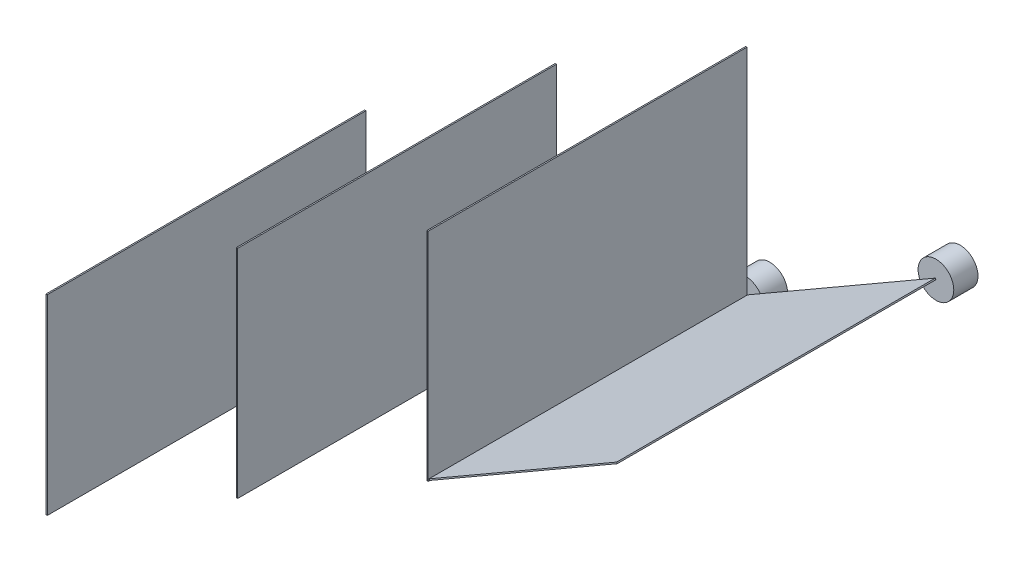
ISO-10303-21;
HEADER;
FILE_DESCRIPTION(('STEP AP214'),'2;1');
FILE_NAME('part.step','',(''),(''),'','','');
FILE_SCHEMA(('AUTOMOTIVE_DESIGN { 1 0 10303 214 1 1 1 1 }'));
ENDSEC;
DATA;
#1=APPLICATION_CONTEXT('core data for automotive mechanical design processes');
#2=APPLICATION_PROTOCOL_DEFINITION('international standard','automotive_design',2000,#1);
#3=PRODUCT_CONTEXT('',#1,'mechanical');
#4=PRODUCT('Part','Part','',(#3));
#5=PRODUCT_RELATED_PRODUCT_CATEGORY('part','',(#4));
#6=PRODUCT_DEFINITION_FORMATION('','',#4);
#7=PRODUCT_DEFINITION_CONTEXT('part definition',#1,'design');
#8=PRODUCT_DEFINITION('design','',#6,#7);
#9=PRODUCT_DEFINITION_SHAPE('','',#8);
#10=(LENGTH_UNIT() NAMED_UNIT(*) SI_UNIT(.MILLI.,.METRE.));
#11=(NAMED_UNIT(*) PLANE_ANGLE_UNIT() SI_UNIT($,.RADIAN.));
#12=(NAMED_UNIT(*) SI_UNIT($,.STERADIAN.) SOLID_ANGLE_UNIT());
#13=UNCERTAINTY_MEASURE_WITH_UNIT(LENGTH_MEASURE(1.E-05),#10,'distance_accuracy_value','');
#14=(GEOMETRIC_REPRESENTATION_CONTEXT(3) GLOBAL_UNCERTAINTY_ASSIGNED_CONTEXT((#13)) GLOBAL_UNIT_ASSIGNED_CONTEXT((#10,
#11,#12)) REPRESENTATION_CONTEXT('',''));
#15=CARTESIAN_POINT('',(0.,0.,0.));
#16=DIRECTION('',(0.,0.,1.));
#17=DIRECTION('',(1.,0.,0.));
#18=AXIS2_PLACEMENT_3D('',#15,#16,#17);
#19=CARTESIAN_POINT('',(-299.943827815092,-173.75,250.));
#20=DIRECTION('',(-1.,0.,0.));
#21=DIRECTION('',(0.,0.,1.));
#22=AXIS2_PLACEMENT_3D('',#19,#20,#21);
#23=PLANE('',#22);
#24=DIRECTION('',(0.,1.,0.));
#25=VECTOR('',#24,1.);
#26=CARTESIAN_POINT('',(-299.943827815092,-173.75,0.));
#27=LINE('',#26,#25);
#28=CARTESIAN_POINT('',(-299.943827815092,-173.75,0.));
#29=VERTEX_POINT('',#28);
#30=CARTESIAN_POINT('',(-299.943827815092,-159.785759956231,0.));
#31=VERTEX_POINT('',#30);
#32=EDGE_CURVE('E103',#29,#31,#27,.T.);
#33=ORIENTED_EDGE('',*,*,#32,.T.);
#34=CARTESIAN_POINT('',(-299.943827815092,-23.7500000000005,0.));
#35=VERTEX_POINT('',#34);
#36=EDGE_CURVE('E116',#31,#35,#27,.T.);
#37=ORIENTED_EDGE('',*,*,#36,.T.);
#38=DIRECTION('',(0.,0.,-1.));
#39=VECTOR('',#38,1.);
#40=CARTESIAN_POINT('',(-299.943827815092,-23.7500000000005,250.));
#41=LINE('',#40,#39);
#42=CARTESIAN_POINT('',(-299.943827815092,-23.7500000000005,250.));
#43=VERTEX_POINT('',#42);
#44=EDGE_CURVE('E12',#43,#35,#41,.T.);
#45=ORIENTED_EDGE('',*,*,#44,.F.);
#46=DIRECTION('',(0.,1.,0.));
#47=VECTOR('',#46,1.);
#48=CARTESIAN_POINT('',(-299.943827815092,-173.75,250.));
#49=LINE('',#48,#47);
#50=CARTESIAN_POINT('',(-299.943827815092,-173.75,250.));
#51=VERTEX_POINT('',#50);
#52=EDGE_CURVE('E132',#51,#43,#49,.T.);
#53=ORIENTED_EDGE('',*,*,#52,.F.);
#54=DIRECTION('',(0.,0.,-1.));
#55=VECTOR('',#54,1.);
#56=CARTESIAN_POINT('',(-299.943827815092,-173.75,250.));
#57=LINE('',#56,#55);
#58=EDGE_CURVE('E123',#51,#29,#57,.T.);
#59=ORIENTED_EDGE('',*,*,#58,.T.);
#60=EDGE_LOOP('',(#33,#37,#45,#53,#59));
#61=FACE_BOUND('',#60,.T.);
#62=ADVANCED_FACE('F50',(#61),#23,.F.);
#63=CARTESIAN_POINT('',(-300.943827815092,-23.7500000000005,250.));
#64=DIRECTION('',(0.,-1.,0.));
#65=DIRECTION('',(0.,0.,-1.));
#66=AXIS2_PLACEMENT_3D('',#63,#64,#65);
#67=PLANE('',#66);
#68=DIRECTION('',(-1.,0.,0.));
#69=VECTOR('',#68,1.);
#70=CARTESIAN_POINT('',(-300.943827815092,-23.7500000000005,0.));
#71=LINE('',#70,#69);
#72=CARTESIAN_POINT('',(-300.943827815092,-23.7500000000005,0.));
#73=VERTEX_POINT('',#72);
#74=EDGE_CURVE('E87',#35,#73,#71,.T.);
#75=ORIENTED_EDGE('',*,*,#74,.T.);
#76=DIRECTION('',(0.,0.,-1.));
#77=VECTOR('',#76,1.);
#78=CARTESIAN_POINT('',(-300.943827815092,-23.7500000000005,250.));
#79=LINE('',#78,#77);
#80=CARTESIAN_POINT('',(-300.943827815092,-23.7500000000005,250.));
#81=VERTEX_POINT('',#80);
#82=EDGE_CURVE('E57',#81,#73,#79,.T.);
#83=ORIENTED_EDGE('',*,*,#82,.F.);
#84=DIRECTION('',(-1.,0.,0.));
#85=VECTOR('',#84,1.);
#86=CARTESIAN_POINT('',(-300.943827815092,-23.7500000000005,250.));
#87=LINE('',#86,#85);
#88=EDGE_CURVE('E92',#43,#81,#87,.T.);
#89=ORIENTED_EDGE('',*,*,#88,.F.);
#90=ORIENTED_EDGE('',*,*,#44,.T.);
#91=EDGE_LOOP('',(#75,#83,#89,#90));
#92=FACE_BOUND('',#91,.T.);
#93=ADVANCED_FACE('F141',(#92),#67,.F.);
#94=CARTESIAN_POINT('',(-300.943827815092,-173.75,250.));
#95=DIRECTION('',(1.,0.,0.));
#96=DIRECTION('',(0.,0.,-1.));
#97=AXIS2_PLACEMENT_3D('',#94,#95,#96);
#98=PLANE('',#97);
#99=DIRECTION('',(0.,-1.,0.));
#100=VECTOR('',#99,1.);
#101=CARTESIAN_POINT('',(-300.943827815092,-173.75,0.));
#102=LINE('',#101,#100);
#103=CARTESIAN_POINT('',(-300.943827815092,-159.75,0.));
#104=VERTEX_POINT('',#103);
#105=EDGE_CURVE('E128',#73,#104,#102,.T.);
#106=ORIENTED_EDGE('',*,*,#105,.T.);
#107=CARTESIAN_POINT('',(-300.943827815092,-173.75,0.));
#108=VERTEX_POINT('',#107);
#109=EDGE_CURVE('E106',#104,#108,#102,.T.);
#110=ORIENTED_EDGE('',*,*,#109,.T.);
#111=DIRECTION('',(0.,0.,-1.));
#112=VECTOR('',#111,1.);
#113=CARTESIAN_POINT('',(-300.943827815092,-173.75,250.));
#114=LINE('',#113,#112);
#115=CARTESIAN_POINT('',(-300.943827815092,-173.75,250.));
#116=VERTEX_POINT('',#115);
#117=EDGE_CURVE('E134',#116,#108,#114,.T.);
#118=ORIENTED_EDGE('',*,*,#117,.F.);
#119=DIRECTION('',(0.,-1.,0.));
#120=VECTOR('',#119,1.);
#121=CARTESIAN_POINT('',(-300.943827815092,-173.75,250.));
#122=LINE('',#121,#120);
#123=EDGE_CURVE('E140',#81,#116,#122,.T.);
#124=ORIENTED_EDGE('',*,*,#123,.F.);
#125=ORIENTED_EDGE('',*,*,#82,.T.);
#126=EDGE_LOOP('',(#106,#110,#118,#124,#125));
#127=FACE_BOUND('',#126,.T.);
#128=ADVANCED_FACE('F138',(#127),#98,.F.);
#129=CARTESIAN_POINT('',(-300.943827815092,-173.75,250.));
#130=DIRECTION('',(0.,1.,0.));
#131=DIRECTION('',(0.,0.,1.));
#132=AXIS2_PLACEMENT_3D('',#129,#130,#131);
#133=PLANE('',#132);
#134=DIRECTION('',(1.,0.,0.));
#135=VECTOR('',#134,1.);
#136=CARTESIAN_POINT('',(-300.943827815092,-173.75,0.));
#137=LINE('',#136,#135);
#138=EDGE_CURVE('E130',#108,#29,#137,.T.);
#139=ORIENTED_EDGE('',*,*,#138,.T.);
#140=ORIENTED_EDGE('',*,*,#58,.F.);
#141=DIRECTION('',(1.,0.,0.));
#142=VECTOR('',#141,1.);
#143=CARTESIAN_POINT('',(-300.943827815092,-173.75,250.));
#144=LINE('',#143,#142);
#145=EDGE_CURVE('E72',#116,#51,#144,.T.);
#146=ORIENTED_EDGE('',*,*,#145,.F.);
#147=ORIENTED_EDGE('',*,*,#117,.T.);
#148=EDGE_LOOP('',(#139,#140,#146,#147));
#149=FACE_BOUND('',#148,.T.);
#150=ADVANCED_FACE('F147',(#149),#133,.F.);
#151=CARTESIAN_POINT('',(0.,0.,250.));
#152=DIRECTION('',(0.,0.,-1.));
#153=DIRECTION('',(-1.,0.,0.));
#154=AXIS2_PLACEMENT_3D('',#151,#152,#153);
#155=PLANE('',#154);
#156=ORIENTED_EDGE('',*,*,#52,.T.);
#157=ORIENTED_EDGE('',*,*,#88,.T.);
#158=ORIENTED_EDGE('',*,*,#123,.T.);
#159=ORIENTED_EDGE('',*,*,#145,.T.);
#160=EDGE_LOOP('',(#156,#157,#158,#159));
#161=FACE_BOUND('',#160,.T.);
#162=ADVANCED_FACE('F152',(#161),#155,.F.);
#163=CARTESIAN_POINT('',(0.,0.,0.));
#164=DIRECTION('',(0.,0.,-1.));
#165=DIRECTION('',(-1.,0.,0.));
#166=AXIS2_PLACEMENT_3D('',#163,#164,#165);
#167=PLANE('',#166);
#168=ORIENTED_EDGE('',*,*,#36,.F.);
#169=CARTESIAN_POINT('',(-300.943827815092,-173.75,0.));
#170=DIRECTION('',(0.,0.,1.));
#171=DIRECTION('',(1.,0.,0.));
#172=AXIS2_PLACEMENT_3D('',#169,#170,#171);
#173=CIRCLE('',#172,14.);
#174=EDGE_CURVE('E108',#31,#104,#173,.T.);
#175=ORIENTED_EDGE('',*,*,#174,.T.);
#176=ORIENTED_EDGE('',*,*,#105,.F.);
#177=ORIENTED_EDGE('',*,*,#74,.F.);
#178=EDGE_LOOP('',(#168,#175,#176,#177));
#179=FACE_BOUND('',#178,.T.);
#180=ADVANCED_FACE('F117',(#179),#167,.T.);
#181=CARTESIAN_POINT('',(-300.943827815092,-173.75,0.));
#182=DIRECTION('',(0.,0.,1.));
#183=DIRECTION('',(1.,0.,0.));
#184=AXIS2_PLACEMENT_3D('',#181,#182,#183);
#185=PLANE('',#184);
#186=ORIENTED_EDGE('',*,*,#32,.F.);
#187=ORIENTED_EDGE('',*,*,#138,.F.);
#188=ORIENTED_EDGE('',*,*,#109,.F.);
#189=EDGE_CURVE('E63',#104,#31,#173,.T.);
#190=ORIENTED_EDGE('',*,*,#189,.T.);
#191=EDGE_LOOP('',(#186,#187,#188,#190));
#192=FACE_BOUND('',#191,.T.);
#193=ADVANCED_FACE('F101',(#192),#185,.T.);
#194=CARTESIAN_POINT('',(-300.943827815092,-173.75,-19.));
#195=DIRECTION('',(0.,0.,1.));
#196=DIRECTION('',(1.,0.,0.));
#197=AXIS2_PLACEMENT_3D('',#194,#195,#196);
#198=CYLINDRICAL_SURFACE('',#197,14.);
#199=CARTESIAN_POINT('',(-300.943827815092,-173.75,-19.));
#200=DIRECTION('',(0.,0.,1.));
#201=DIRECTION('',(1.,0.,0.));
#202=AXIS2_PLACEMENT_3D('',#199,#200,#201);
#203=CIRCLE('',#202,14.);
#204=CARTESIAN_POINT('',(-286.943827815092,-173.75,-19.));
#205=VERTEX_POINT('',#204);
#206=EDGE_CURVE('E115',#205,#205,#203,.T.);
#207=ORIENTED_EDGE('',*,*,#206,.T.);
#208=EDGE_LOOP('',(#207));
#209=FACE_BOUND('',#208,.T.);
#210=ORIENTED_EDGE('',*,*,#174,.F.);
#211=ORIENTED_EDGE('',*,*,#189,.F.);
#212=EDGE_LOOP('',(#210,#211));
#213=FACE_BOUND('',#212,.T.);
#214=ADVANCED_FACE('F111',(#209,#213),#198,.T.);
#215=CARTESIAN_POINT('',(-300.943827815092,-173.75,-19.));
#216=DIRECTION('',(0.,0.,1.));
#217=DIRECTION('',(1.,0.,0.));
#218=AXIS2_PLACEMENT_3D('',#215,#216,#217);
#219=PLANE('',#218);
#220=ORIENTED_EDGE('',*,*,#206,.F.);
#221=EDGE_LOOP('',(#220));
#222=FACE_BOUND('',#221,.T.);
#223=ADVANCED_FACE('F160',(#222),#219,.F.);
#224=CLOSED_SHELL('',(#62,#93,#128,#150,#162,#180,#193,#214,#223));
#225=MANIFOLD_SOLID_BREP('B2',#224);
#226=CARTESIAN_POINT('',(-150.554445662277,-87.5000000000002,250.));
#227=DIRECTION('',(-1.,0.,0.));
#228=DIRECTION('',(0.,0.,1.));
#229=AXIS2_PLACEMENT_3D('',#226,#227,#228);
#230=PLANE('',#229);
#231=DIRECTION('',(0.,1.,0.));
#232=VECTOR('',#231,1.);
#233=CARTESIAN_POINT('',(-150.554445662277,-87.5000000000002,0.));
#234=LINE('',#233,#232);
#235=CARTESIAN_POINT('',(-150.554445662277,-87.5000000000002,0.));
#236=VERTEX_POINT('',#235);
#237=CARTESIAN_POINT('',(-150.554445662277,-73.5357599562313,0.));
#238=VERTEX_POINT('',#237);
#239=EDGE_CURVE('E288',#236,#238,#234,.T.);
#240=ORIENTED_EDGE('',*,*,#239,.T.);
#241=CARTESIAN_POINT('',(-150.554445662277,82.4999999999998,0.));
#242=VERTEX_POINT('',#241);
#243=EDGE_CURVE('E301',#238,#242,#234,.T.);
#244=ORIENTED_EDGE('',*,*,#243,.T.);
#245=DIRECTION('',(0.,0.,-1.));
#246=VECTOR('',#245,1.);
#247=CARTESIAN_POINT('',(-150.554445662277,82.4999999999998,250.));
#248=LINE('',#247,#246);
#249=CARTESIAN_POINT('',(-150.554445662277,82.4999999999998,250.));
#250=VERTEX_POINT('',#249);
#251=EDGE_CURVE('E48',#250,#242,#248,.T.);
#252=ORIENTED_EDGE('',*,*,#251,.F.);
#253=DIRECTION('',(0.,1.,0.));
#254=VECTOR('',#253,1.);
#255=CARTESIAN_POINT('',(-150.554445662277,-87.5000000000002,250.));
#256=LINE('',#255,#254);
#257=CARTESIAN_POINT('',(-150.554445662277,-87.5000000000002,250.));
#258=VERTEX_POINT('',#257);
#259=EDGE_CURVE('E317',#258,#250,#256,.T.);
#260=ORIENTED_EDGE('',*,*,#259,.F.);
#261=DIRECTION('',(0.,0.,-1.));
#262=VECTOR('',#261,1.);
#263=CARTESIAN_POINT('',(-150.554445662277,-87.5000000000002,250.));
#264=LINE('',#263,#262);
#265=EDGE_CURVE('E308',#258,#236,#264,.T.);
#266=ORIENTED_EDGE('',*,*,#265,.T.);
#267=EDGE_LOOP('',(#240,#244,#252,#260,#266));
#268=FACE_BOUND('',#267,.T.);
#269=ADVANCED_FACE('F235',(#268),#230,.F.);
#270=CARTESIAN_POINT('',(-151.554445662277,82.4999999999998,250.));
#271=DIRECTION('',(0.,-1.,0.));
#272=DIRECTION('',(0.,0.,-1.));
#273=AXIS2_PLACEMENT_3D('',#270,#271,#272);
#274=PLANE('',#273);
#275=DIRECTION('',(-1.,0.,0.));
#276=VECTOR('',#275,1.);
#277=CARTESIAN_POINT('',(-151.554445662277,82.4999999999998,0.));
#278=LINE('',#277,#276);
#279=CARTESIAN_POINT('',(-151.554445662277,82.4999999999998,0.));
#280=VERTEX_POINT('',#279);
#281=EDGE_CURVE('E272',#242,#280,#278,.T.);
#282=ORIENTED_EDGE('',*,*,#281,.T.);
#283=DIRECTION('',(0.,0.,-1.));
#284=VECTOR('',#283,1.);
#285=CARTESIAN_POINT('',(-151.554445662277,82.4999999999998,250.));
#286=LINE('',#285,#284);
#287=CARTESIAN_POINT('',(-151.554445662277,82.4999999999998,250.));
#288=VERTEX_POINT('',#287);
#289=EDGE_CURVE('E242',#288,#280,#286,.T.);
#290=ORIENTED_EDGE('',*,*,#289,.F.);
#291=DIRECTION('',(-1.,0.,0.));
#292=VECTOR('',#291,1.);
#293=CARTESIAN_POINT('',(-151.554445662277,82.4999999999998,250.));
#294=LINE('',#293,#292);
#295=EDGE_CURVE('E277',#250,#288,#294,.T.);
#296=ORIENTED_EDGE('',*,*,#295,.F.);
#297=ORIENTED_EDGE('',*,*,#251,.T.);
#298=EDGE_LOOP('',(#282,#290,#296,#297));
#299=FACE_BOUND('',#298,.T.);
#300=ADVANCED_FACE('F326',(#299),#274,.F.);
#301=CARTESIAN_POINT('',(-151.554445662277,-87.5000000000002,250.));
#302=DIRECTION('',(1.,0.,0.));
#303=DIRECTION('',(0.,0.,-1.));
#304=AXIS2_PLACEMENT_3D('',#301,#302,#303);
#305=PLANE('',#304);
#306=DIRECTION('',(0.,-1.,0.));
#307=VECTOR('',#306,1.);
#308=CARTESIAN_POINT('',(-151.554445662277,-87.5000000000002,0.));
#309=LINE('',#308,#307);
#310=CARTESIAN_POINT('',(-151.554445662277,-73.5000000000002,0.));
#311=VERTEX_POINT('',#310);
#312=EDGE_CURVE('E313',#280,#311,#309,.T.);
#313=ORIENTED_EDGE('',*,*,#312,.T.);
#314=CARTESIAN_POINT('',(-151.554445662277,-87.5000000000002,0.));
#315=VERTEX_POINT('',#314);
#316=EDGE_CURVE('E291',#311,#315,#309,.T.);
#317=ORIENTED_EDGE('',*,*,#316,.T.);
#318=DIRECTION('',(0.,0.,-1.));
#319=VECTOR('',#318,1.);
#320=CARTESIAN_POINT('',(-151.554445662277,-87.5000000000002,250.));
#321=LINE('',#320,#319);
#322=CARTESIAN_POINT('',(-151.554445662277,-87.5000000000002,250.));
#323=VERTEX_POINT('',#322);
#324=EDGE_CURVE('E319',#323,#315,#321,.T.);
#325=ORIENTED_EDGE('',*,*,#324,.F.);
#326=DIRECTION('',(0.,-1.,0.));
#327=VECTOR('',#326,1.);
#328=CARTESIAN_POINT('',(-151.554445662277,-87.5000000000002,250.));
#329=LINE('',#328,#327);
#330=EDGE_CURVE('E325',#288,#323,#329,.T.);
#331=ORIENTED_EDGE('',*,*,#330,.F.);
#332=ORIENTED_EDGE('',*,*,#289,.T.);
#333=EDGE_LOOP('',(#313,#317,#325,#331,#332));
#334=FACE_BOUND('',#333,.T.);
#335=ADVANCED_FACE('F323',(#334),#305,.F.);
#336=CARTESIAN_POINT('',(-151.554445662277,-87.5000000000002,250.));
#337=DIRECTION('',(0.,1.,0.));
#338=DIRECTION('',(-1.,0.,0.));
#339=AXIS2_PLACEMENT_3D('',#336,#337,#338);
#340=PLANE('',#339);
#341=DIRECTION('',(1.,0.,0.));
#342=VECTOR('',#341,1.);
#343=CARTESIAN_POINT('',(-151.554445662277,-87.5000000000002,0.));
#344=LINE('',#343,#342);
#345=EDGE_CURVE('E315',#315,#236,#344,.T.);
#346=ORIENTED_EDGE('',*,*,#345,.T.);
#347=ORIENTED_EDGE('',*,*,#265,.F.);
#348=DIRECTION('',(1.,0.,0.));
#349=VECTOR('',#348,1.);
#350=CARTESIAN_POINT('',(-151.554445662277,-87.5000000000002,250.));
#351=LINE('',#350,#349);
#352=EDGE_CURVE('E257',#323,#258,#351,.T.);
#353=ORIENTED_EDGE('',*,*,#352,.F.);
#354=ORIENTED_EDGE('',*,*,#324,.T.);
#355=EDGE_LOOP('',(#346,#347,#353,#354));
#356=FACE_BOUND('',#355,.T.);
#357=ADVANCED_FACE('F332',(#356),#340,.F.);
#358=CARTESIAN_POINT('',(0.,0.,250.));
#359=DIRECTION('',(0.,0.,-1.));
#360=DIRECTION('',(-1.,0.,0.));
#361=AXIS2_PLACEMENT_3D('',#358,#359,#360);
#362=PLANE('',#361);
#363=ORIENTED_EDGE('',*,*,#259,.T.);
#364=ORIENTED_EDGE('',*,*,#295,.T.);
#365=ORIENTED_EDGE('',*,*,#330,.T.);
#366=ORIENTED_EDGE('',*,*,#352,.T.);
#367=EDGE_LOOP('',(#363,#364,#365,#366));
#368=FACE_BOUND('',#367,.T.);
#369=ADVANCED_FACE('F337',(#368),#362,.F.);
#370=CARTESIAN_POINT('',(0.,0.,0.));
#371=DIRECTION('',(0.,0.,-1.));
#372=DIRECTION('',(-1.,0.,0.));
#373=AXIS2_PLACEMENT_3D('',#370,#371,#372);
#374=PLANE('',#373);
#375=ORIENTED_EDGE('',*,*,#243,.F.);
#376=CARTESIAN_POINT('',(-151.554445662277,-87.5000000000002,0.));
#377=DIRECTION('',(0.,0.,1.));
#378=DIRECTION('',(1.,0.,0.));
#379=AXIS2_PLACEMENT_3D('',#376,#377,#378);
#380=CIRCLE('',#379,14.);
#381=EDGE_CURVE('E293',#238,#311,#380,.T.);
#382=ORIENTED_EDGE('',*,*,#381,.T.);
#383=ORIENTED_EDGE('',*,*,#312,.F.);
#384=ORIENTED_EDGE('',*,*,#281,.F.);
#385=EDGE_LOOP('',(#375,#382,#383,#384));
#386=FACE_BOUND('',#385,.T.);
#387=ADVANCED_FACE('F302',(#386),#374,.T.);
#388=CARTESIAN_POINT('',(-151.554445662277,-87.5000000000002,0.));
#389=DIRECTION('',(0.,0.,1.));
#390=DIRECTION('',(1.,0.,0.));
#391=AXIS2_PLACEMENT_3D('',#388,#389,#390);
#392=PLANE('',#391);
#393=ORIENTED_EDGE('',*,*,#239,.F.);
#394=ORIENTED_EDGE('',*,*,#345,.F.);
#395=ORIENTED_EDGE('',*,*,#316,.F.);
#396=EDGE_CURVE('E248',#311,#238,#380,.T.);
#397=ORIENTED_EDGE('',*,*,#396,.T.);
#398=EDGE_LOOP('',(#393,#394,#395,#397));
#399=FACE_BOUND('',#398,.T.);
#400=ADVANCED_FACE('F286',(#399),#392,.T.);
#401=CARTESIAN_POINT('',(-151.554445662277,-87.5000000000002,-19.));
#402=DIRECTION('',(0.,0.,1.));
#403=DIRECTION('',(1.,0.,0.));
#404=AXIS2_PLACEMENT_3D('',#401,#402,#403);
#405=CYLINDRICAL_SURFACE('',#404,14.);
#406=CARTESIAN_POINT('',(-151.554445662277,-87.5000000000002,-19.));
#407=DIRECTION('',(0.,0.,1.));
#408=DIRECTION('',(1.,0.,0.));
#409=AXIS2_PLACEMENT_3D('',#406,#407,#408);
#410=CIRCLE('',#409,14.);
#411=CARTESIAN_POINT('',(-137.554445662277,-87.5000000000002,-19.));
#412=VERTEX_POINT('',#411);
#413=EDGE_CURVE('E294',#412,#412,#410,.T.);
#414=ORIENTED_EDGE('',*,*,#413,.T.);
#415=EDGE_LOOP('',(#414));
#416=FACE_BOUND('',#415,.T.);
#417=ORIENTED_EDGE('',*,*,#381,.F.);
#418=ORIENTED_EDGE('',*,*,#396,.F.);
#419=EDGE_LOOP('',(#417,#418));
#420=FACE_BOUND('',#419,.T.);
#421=ADVANCED_FACE('F297',(#416,#420),#405,.T.);
#422=CARTESIAN_POINT('',(-151.554445662277,-87.5000000000002,-19.));
#423=DIRECTION('',(0.,0.,1.));
#424=DIRECTION('',(1.,0.,0.));
#425=AXIS2_PLACEMENT_3D('',#422,#423,#424);
#426=PLANE('',#425);
#427=ORIENTED_EDGE('',*,*,#413,.F.);
#428=EDGE_LOOP('',(#427));
#429=FACE_BOUND('',#428,.T.);
#430=ADVANCED_FACE('F343',(#429),#426,.F.);
#431=CLOSED_SHELL('',(#269,#300,#335,#357,#369,#387,#400,#421,#430));
#432=MANIFOLD_SOLID_BREP('B6',#431);
#433=CARTESIAN_POINT('',(-2.1650635094611,-1.25,0.));
#434=DIRECTION('',(0.,0.,1.));
#435=DIRECTION('',(1.,0.,0.));
#436=AXIS2_PLACEMENT_3D('',#433,#434,#435);
#437=PLANE('',#436);
#438=DIRECTION('',(1.,0.,0.));
#439=VECTOR('',#438,1.);
#440=CARTESIAN_POINT('',(-1.1650635094611,-1.25,0.));
#441=LINE('',#440,#439);
#442=CARTESIAN_POINT('',(-2.1650635094611,-1.25,0.));
#443=VERTEX_POINT('',#442);
#444=CARTESIAN_POINT('',(-1.1650635094611,-1.25,0.));
#445=VERTEX_POINT('',#444);
#446=EDGE_CURVE('E435',#443,#445,#441,.T.);
#447=ORIENTED_EDGE('',*,*,#446,.F.);
#448=DIRECTION('',(0.,-1.,0.));
#449=VECTOR('',#448,1.);
#450=CARTESIAN_POINT('',(-2.1650635094611,-1.25,0.));
#451=LINE('',#450,#449);
#452=CARTESIAN_POINT('',(-2.1650635094611,12.75,0.));
#453=VERTEX_POINT('',#452);
#454=EDGE_CURVE('E529',#453,#443,#451,.T.);
#455=ORIENTED_EDGE('',*,*,#454,.F.);
#456=CARTESIAN_POINT('',(-2.1650635094611,-1.25,0.));
#457=DIRECTION('',(0.,0.,1.));
#458=DIRECTION('',(1.,0.,0.));
#459=AXIS2_PLACEMENT_3D('',#456,#457,#458);
#460=CIRCLE('',#459,14.);
#461=CARTESIAN_POINT('',(9.95929214352104,5.75000000000001,0.));
#462=VERTEX_POINT('',#461);
#463=EDGE_CURVE('E583',#453,#462,#460,.T.);
#464=ORIENTED_EDGE('',*,*,#463,.T.);
#465=DIRECTION('',(0.866025403784438,0.500000000000001,0.));
#466=VECTOR('',#465,1.);
#467=CARTESIAN_POINT('',(0.,0.,0.));
#468=LINE('',#467,#466);
#469=CARTESIAN_POINT('',(0.,0.,0.));
#470=VERTEX_POINT('',#469);
#471=EDGE_CURVE('E603',#470,#462,#468,.T.);
#472=ORIENTED_EDGE('',*,*,#471,.F.);
#473=DIRECTION('',(0.500000000000002,-0.866025403784438,0.));
#474=VECTOR('',#473,1.);
#475=CARTESIAN_POINT('',(0.,0.,0.));
#476=LINE('',#475,#474);
#477=CARTESIAN_POINT('',(-0.500000000000002,0.866025403784438,0.));
#478=VERTEX_POINT('',#477);
#479=EDGE_CURVE('E581',#478,#470,#476,.T.);
#480=ORIENTED_EDGE('',*,*,#479,.F.);
#481=DIRECTION('',(-0.866025403784438,-0.500000000000001,0.));
#482=VECTOR('',#481,1.);
#483=CARTESIAN_POINT('',(-0.500000000000002,0.866025403784438,0.));
#484=LINE('',#483,#482);
#485=CARTESIAN_POINT('',(9.42832311298672,6.59814542566892,0.));
#486=VERTEX_POINT('',#485);
#487=EDGE_CURVE('E512',#486,#478,#484,.T.);
#488=ORIENTED_EDGE('',*,*,#487,.F.);
#489=CARTESIAN_POINT('',(-1.1650635094611,12.7142400437689,0.));
#490=VERTEX_POINT('',#489);
#491=EDGE_CURVE('E582',#486,#490,#460,.T.);
#492=ORIENTED_EDGE('',*,*,#491,.T.);
#493=DIRECTION('',(0.,1.,0.));
#494=VECTOR('',#493,1.);
#495=CARTESIAN_POINT('',(-1.1650635094611,-1.25,0.));
#496=LINE('',#495,#494);
#497=EDGE_CURVE('E557',#445,#490,#496,.T.);
#498=ORIENTED_EDGE('',*,*,#497,.F.);
#499=EDGE_LOOP('',(#447,#455,#464,#472,#480,#488,#492,#498));
#500=FACE_BOUND('',#499,.T.);
#501=ADVANCED_FACE('F411',(#500),#437,.T.);
#502=CARTESIAN_POINT('',(0.,0.,250.));
#503=DIRECTION('',(0.866025403784438,0.500000000000001,0.));
#504=DIRECTION('',(-0.500000000000002,0.866025403784438,0.));
#505=AXIS2_PLACEMENT_3D('',#502,#503,#504);
#506=PLANE('',#505);
#507=ORIENTED_EDGE('',*,*,#479,.T.);
#508=DIRECTION('',(0.,0.,-1.));
#509=VECTOR('',#508,1.);
#510=CARTESIAN_POINT('',(0.,0.,250.));
#511=LINE('',#510,#509);
#512=CARTESIAN_POINT('',(0.,0.,250.));
#513=VERTEX_POINT('',#512);
#514=EDGE_CURVE('E233',#513,#470,#511,.T.);
#515=ORIENTED_EDGE('',*,*,#514,.F.);
#516=DIRECTION('',(0.500000000000002,-0.866025403784438,0.));
#517=VECTOR('',#516,1.);
#518=CARTESIAN_POINT('',(0.,0.,250.));
#519=LINE('',#518,#517);
#520=CARTESIAN_POINT('',(-0.500000000000002,0.866025403784438,250.));
#521=VERTEX_POINT('',#520);
#522=EDGE_CURVE('E510',#521,#513,#519,.T.);
#523=ORIENTED_EDGE('',*,*,#522,.F.);
#524=DIRECTION('',(0.,0.,-1.));
#525=VECTOR('',#524,1.);
#526=CARTESIAN_POINT('',(-0.500000000000002,0.866025403784438,250.));
#527=LINE('',#526,#525);
#528=EDGE_CURVE('E599',#521,#478,#527,.T.);
#529=ORIENTED_EDGE('',*,*,#528,.T.);
#530=EDGE_LOOP('',(#507,#515,#523,#529));
#531=FACE_BOUND('',#530,.T.);
#532=ADVANCED_FACE('F413',(#531),#506,.F.);
#533=CARTESIAN_POINT('',(0.,0.,250.));
#534=DIRECTION('',(-0.500000000000001,0.866025403784438,0.));
#535=DIRECTION('',(-0.866025403784438,-0.500000000000001,0.));
#536=AXIS2_PLACEMENT_3D('',#533,#534,#535);
#537=PLANE('',#536);
#538=ORIENTED_EDGE('',*,*,#471,.T.);
#539=CARTESIAN_POINT('',(135.099962990372,78.0000000000002,0.));
#540=VERTEX_POINT('',#539);
#541=EDGE_CURVE('E608',#462,#540,#468,.T.);
#542=ORIENTED_EDGE('',*,*,#541,.T.);
#543=CARTESIAN_POINT('',(147.224318643355,85.0000000000002,0.));
#544=VERTEX_POINT('',#543);
#545=EDGE_CURVE('E522',#540,#544,#468,.T.);
#546=ORIENTED_EDGE('',*,*,#545,.T.);
#547=DIRECTION('',(0.,0.,-1.));
#548=VECTOR('',#547,1.);
#549=CARTESIAN_POINT('',(147.224318643355,85.0000000000002,250.));
#550=LINE('',#549,#548);
#551=CARTESIAN_POINT('',(147.224318643355,85.0000000000002,250.));
#552=VERTEX_POINT('',#551);
#553=EDGE_CURVE('E420',#552,#544,#550,.T.);
#554=ORIENTED_EDGE('',*,*,#553,.F.);
#555=DIRECTION('',(0.866025403784438,0.500000000000001,0.));
#556=VECTOR('',#555,1.);
#557=CARTESIAN_POINT('',(0.,0.,250.));
#558=LINE('',#557,#556);
#559=EDGE_CURVE('E590',#513,#552,#558,.T.);
#560=ORIENTED_EDGE('',*,*,#559,.F.);
#561=ORIENTED_EDGE('',*,*,#514,.T.);
#562=EDGE_LOOP('',(#538,#542,#546,#554,#560,#561));
#563=FACE_BOUND('',#562,.T.);
#564=ADVANCED_FACE('F622',(#563),#537,.F.);
#565=CARTESIAN_POINT('',(147.224318643355,85.0000000000002,250.));
#566=DIRECTION('',(-0.866025403784416,-0.50000000000004,0.));
#567=DIRECTION('',(0.50000000000004,-0.866025403784415,0.));
#568=AXIS2_PLACEMENT_3D('',#565,#566,#567);
#569=PLANE('',#568);
#570=DIRECTION('',(-0.50000000000004,0.866025403784415,0.));
#571=VECTOR('',#570,1.);
#572=CARTESIAN_POINT('',(147.224318643355,85.0000000000002,0.));
#573=LINE('',#572,#571);
#574=CARTESIAN_POINT('',(146.724318643354,85.8660254037847,0.));
#575=VERTEX_POINT('',#574);
#576=EDGE_CURVE('E607',#544,#575,#573,.T.);
#577=ORIENTED_EDGE('',*,*,#576,.T.);
#578=DIRECTION('',(0.,0.,-1.));
#579=VECTOR('',#578,1.);
#580=CARTESIAN_POINT('',(146.724318643354,85.8660254037847,250.));
#581=LINE('',#580,#579);
#582=CARTESIAN_POINT('',(146.724318643354,85.8660254037847,250.));
#583=VERTEX_POINT('',#582);
#584=EDGE_CURVE('E505',#583,#575,#581,.T.);
#585=ORIENTED_EDGE('',*,*,#584,.F.);
#586=DIRECTION('',(-0.50000000000004,0.866025403784415,0.));
#587=VECTOR('',#586,1.);
#588=CARTESIAN_POINT('',(147.224318643355,85.0000000000002,250.));
#589=LINE('',#588,#587);
#590=EDGE_CURVE('E593',#552,#583,#589,.T.);
#591=ORIENTED_EDGE('',*,*,#590,.F.);
#592=ORIENTED_EDGE('',*,*,#553,.T.);
#593=EDGE_LOOP('',(#577,#585,#591,#592));
#594=FACE_BOUND('',#593,.T.);
#595=ADVANCED_FACE('F620',(#594),#569,.F.);
#596=CARTESIAN_POINT('',(-0.500000000000002,0.866025403784438,250.));
#597=DIRECTION('',(0.500000000000001,-0.866025403784438,0.));
#598=DIRECTION('',(0.866025403784438,0.500000000000001,0.));
#599=AXIS2_PLACEMENT_3D('',#596,#597,#598);
#600=PLANE('',#599);
#601=CARTESIAN_POINT('',(134.630932020907,78.8839053819002,0.));
#602=VERTEX_POINT('',#601);
#603=EDGE_CURVE('E498',#575,#602,#484,.T.);
#604=ORIENTED_EDGE('',*,*,#603,.T.);
#605=EDGE_CURVE('E501',#602,#486,#484,.T.);
#606=ORIENTED_EDGE('',*,*,#605,.T.);
#607=ORIENTED_EDGE('',*,*,#487,.T.);
#608=ORIENTED_EDGE('',*,*,#528,.F.);
#609=DIRECTION('',(-0.866025403784438,-0.500000000000001,0.));
#610=VECTOR('',#609,1.);
#611=CARTESIAN_POINT('',(-0.500000000000002,0.866025403784438,250.));
#612=LINE('',#611,#610);
#613=EDGE_CURVE('E596',#583,#521,#612,.T.);
#614=ORIENTED_EDGE('',*,*,#613,.F.);
#615=ORIENTED_EDGE('',*,*,#584,.T.);
#616=EDGE_LOOP('',(#604,#606,#607,#608,#614,#615));
#617=FACE_BOUND('',#616,.T.);
#618=ADVANCED_FACE('F499',(#617),#600,.F.);
#619=CARTESIAN_POINT('',(0.,0.,250.));
#620=DIRECTION('',(0.,0.,-1.));
#621=DIRECTION('',(-1.,0.,0.));
#622=AXIS2_PLACEMENT_3D('',#619,#620,#621);
#623=PLANE('',#622);
#624=ORIENTED_EDGE('',*,*,#522,.T.);
#625=ORIENTED_EDGE('',*,*,#559,.T.);
#626=ORIENTED_EDGE('',*,*,#590,.T.);
#627=ORIENTED_EDGE('',*,*,#613,.T.);
#628=EDGE_LOOP('',(#624,#625,#626,#627));
#629=FACE_BOUND('',#628,.T.);
#630=ADVANCED_FACE('F633',(#629),#623,.F.);
#631=CARTESIAN_POINT('',(0.,0.,0.));
#632=DIRECTION('',(0.,0.,-1.));
#633=DIRECTION('',(-1.,0.,0.));
#634=AXIS2_PLACEMENT_3D('',#631,#632,#633);
#635=PLANE('',#634);
#636=CARTESIAN_POINT('',(147.224318643355,85.0000000000002,0.));
#637=DIRECTION('',(0.,0.,1.));
#638=DIRECTION('',(1.,0.,0.));
#639=AXIS2_PLACEMENT_3D('',#636,#637,#638);
#640=CIRCLE('',#639,14.);
#641=EDGE_CURVE('E427',#602,#540,#640,.T.);
#642=ORIENTED_EDGE('',*,*,#641,.T.);
#643=ORIENTED_EDGE('',*,*,#541,.F.);
#644=EDGE_CURVE('E516',#462,#486,#460,.T.);
#645=ORIENTED_EDGE('',*,*,#644,.T.);
#646=ORIENTED_EDGE('',*,*,#605,.F.);
#647=EDGE_LOOP('',(#642,#643,#645,#646));
#648=FACE_BOUND('',#647,.T.);
#649=ADVANCED_FACE('F514',(#648),#635,.T.);
#650=CARTESIAN_POINT('',(-2.1650635094611,-1.25,-19.));
#651=DIRECTION('',(0.,0.,1.));
#652=DIRECTION('',(1.,0.,0.));
#653=AXIS2_PLACEMENT_3D('',#650,#651,#652);
#654=CYLINDRICAL_SURFACE('',#653,14.);
#655=CARTESIAN_POINT('',(-2.1650635094611,-1.25,-19.));
#656=DIRECTION('',(0.,0.,1.));
#657=DIRECTION('',(1.,0.,0.));
#658=AXIS2_PLACEMENT_3D('',#655,#656,#657);
#659=CIRCLE('',#658,14.);
#660=CARTESIAN_POINT('',(11.8349364905389,-1.25,-19.));
#661=VERTEX_POINT('',#660);
#662=EDGE_CURVE('E578',#661,#661,#659,.T.);
#663=ORIENTED_EDGE('',*,*,#662,.T.);
#664=EDGE_LOOP('',(#663));
#665=FACE_BOUND('',#664,.T.);
#666=ORIENTED_EDGE('',*,*,#644,.F.);
#667=ORIENTED_EDGE('',*,*,#463,.F.);
#668=EDGE_CURVE('E666',#490,#453,#460,.T.);
#669=ORIENTED_EDGE('',*,*,#668,.F.);
#670=ORIENTED_EDGE('',*,*,#491,.F.);
#671=EDGE_LOOP('',(#666,#667,#669,#670));
#672=FACE_BOUND('',#671,.T.);
#673=ADVANCED_FACE('F640',(#665,#672),#654,.T.);
#674=CARTESIAN_POINT('',(-2.1650635094611,-1.25,-19.));
#675=DIRECTION('',(0.,0.,1.));
#676=DIRECTION('',(1.,0.,0.));
#677=AXIS2_PLACEMENT_3D('',#674,#675,#676);
#678=PLANE('',#677);
#679=ORIENTED_EDGE('',*,*,#662,.F.);
#680=EDGE_LOOP('',(#679));
#681=FACE_BOUND('',#680,.T.);
#682=ADVANCED_FACE('F651',(#681),#678,.F.);
#683=CARTESIAN_POINT('',(-2.1650635094611,-1.25,250.));
#684=DIRECTION('',(1.,0.,0.));
#685=DIRECTION('',(0.,0.,-1.));
#686=AXIS2_PLACEMENT_3D('',#683,#684,#685);
#687=PLANE('',#686);
#688=CARTESIAN_POINT('',(-2.1650635094611,168.75,0.));
#689=VERTEX_POINT('',#688);
#690=EDGE_CURVE('E531',#689,#453,#451,.T.);
#691=ORIENTED_EDGE('',*,*,#690,.T.);
#692=ORIENTED_EDGE('',*,*,#454,.T.);
#693=DIRECTION('',(0.,0.,-1.));
#694=VECTOR('',#693,1.);
#695=CARTESIAN_POINT('',(-2.1650635094611,-1.25,250.));
#696=LINE('',#695,#694);
#697=CARTESIAN_POINT('',(-2.1650635094611,-1.25,250.));
#698=VERTEX_POINT('',#697);
#699=EDGE_CURVE('E574',#698,#443,#696,.T.);
#700=ORIENTED_EDGE('',*,*,#699,.F.);
#701=DIRECTION('',(0.,-1.,0.));
#702=VECTOR('',#701,1.);
#703=CARTESIAN_POINT('',(-2.1650635094611,-1.25,250.));
#704=LINE('',#703,#702);
#705=CARTESIAN_POINT('',(-2.1650635094611,168.75,250.));
#706=VERTEX_POINT('',#705);
#707=EDGE_CURVE('E537',#706,#698,#704,.T.);
#708=ORIENTED_EDGE('',*,*,#707,.F.);
#709=DIRECTION('',(0.,0.,-1.));
#710=VECTOR('',#709,1.);
#711=CARTESIAN_POINT('',(-2.1650635094611,168.75,250.));
#712=LINE('',#711,#710);
#713=EDGE_CURVE('E550',#706,#689,#712,.T.);
#714=ORIENTED_EDGE('',*,*,#713,.T.);
#715=EDGE_LOOP('',(#691,#692,#700,#708,#714));
#716=FACE_BOUND('',#715,.T.);
#717=ADVANCED_FACE('F653',(#716),#687,.F.);
#718=CARTESIAN_POINT('',(-1.1650635094611,-1.25,250.));
#719=DIRECTION('',(0.,1.,0.));
#720=DIRECTION('',(0.,0.,1.));
#721=AXIS2_PLACEMENT_3D('',#718,#719,#720);
#722=PLANE('',#721);
#723=ORIENTED_EDGE('',*,*,#446,.T.);
#724=DIRECTION('',(0.,0.,-1.));
#725=VECTOR('',#724,1.);
#726=CARTESIAN_POINT('',(-1.1650635094611,-1.25,250.));
#727=LINE('',#726,#725);
#728=CARTESIAN_POINT('',(-1.1650635094611,-1.25,250.));
#729=VERTEX_POINT('',#728);
#730=EDGE_CURVE('E570',#729,#445,#727,.T.);
#731=ORIENTED_EDGE('',*,*,#730,.F.);
#732=DIRECTION('',(1.,0.,0.));
#733=VECTOR('',#732,1.);
#734=CARTESIAN_POINT('',(-1.1650635094611,-1.25,250.));
#735=LINE('',#734,#733);
#736=EDGE_CURVE('E541',#698,#729,#735,.T.);
#737=ORIENTED_EDGE('',*,*,#736,.F.);
#738=ORIENTED_EDGE('',*,*,#699,.T.);
#739=EDGE_LOOP('',(#723,#731,#737,#738));
#740=FACE_BOUND('',#739,.T.);
#741=ADVANCED_FACE('F659',(#740),#722,.F.);
#742=CARTESIAN_POINT('',(-1.1650635094611,-1.25,250.));
#743=DIRECTION('',(-1.,0.,0.));
#744=DIRECTION('',(0.,0.,1.));
#745=AXIS2_PLACEMENT_3D('',#742,#743,#744);
#746=PLANE('',#745);
#747=ORIENTED_EDGE('',*,*,#497,.T.);
#748=CARTESIAN_POINT('',(-1.1650635094611,168.75,0.));
#749=VERTEX_POINT('',#748);
#750=EDGE_CURVE('E556',#490,#749,#496,.T.);
#751=ORIENTED_EDGE('',*,*,#750,.T.);
#752=DIRECTION('',(0.,0.,-1.));
#753=VECTOR('',#752,1.);
#754=CARTESIAN_POINT('',(-1.1650635094611,168.75,250.));
#755=LINE('',#754,#753);
#756=CARTESIAN_POINT('',(-1.1650635094611,168.75,250.));
#757=VERTEX_POINT('',#756);
#758=EDGE_CURVE('E566',#757,#749,#755,.T.);
#759=ORIENTED_EDGE('',*,*,#758,.F.);
#760=DIRECTION('',(0.,1.,0.));
#761=VECTOR('',#760,1.);
#762=CARTESIAN_POINT('',(-1.1650635094611,-1.25,250.));
#763=LINE('',#762,#761);
#764=EDGE_CURVE('E545',#729,#757,#763,.T.);
#765=ORIENTED_EDGE('',*,*,#764,.F.);
#766=ORIENTED_EDGE('',*,*,#730,.T.);
#767=EDGE_LOOP('',(#747,#751,#759,#765,#766));
#768=FACE_BOUND('',#767,.T.);
#769=ADVANCED_FACE('F677',(#768),#746,.F.);
#770=CARTESIAN_POINT('',(-1.1650635094611,168.75,250.));
#771=DIRECTION('',(0.,-1.,0.));
#772=DIRECTION('',(0.,0.,-1.));
#773=AXIS2_PLACEMENT_3D('',#770,#771,#772);
#774=PLANE('',#773);
#775=DIRECTION('',(-1.,0.,0.));
#776=VECTOR('',#775,1.);
#777=CARTESIAN_POINT('',(-1.1650635094611,168.75,0.));
#778=LINE('',#777,#776);
#779=EDGE_CURVE('E542',#749,#689,#778,.T.);
#780=ORIENTED_EDGE('',*,*,#779,.T.);
#781=ORIENTED_EDGE('',*,*,#713,.F.);
#782=DIRECTION('',(-1.,0.,0.));
#783=VECTOR('',#782,1.);
#784=CARTESIAN_POINT('',(-1.1650635094611,168.75,250.));
#785=LINE('',#784,#783);
#786=EDGE_CURVE('E548',#757,#706,#785,.T.);
#787=ORIENTED_EDGE('',*,*,#786,.F.);
#788=ORIENTED_EDGE('',*,*,#758,.T.);
#789=EDGE_LOOP('',(#780,#781,#787,#788));
#790=FACE_BOUND('',#789,.T.);
#791=ADVANCED_FACE('F686',(#790),#774,.F.);
#792=CARTESIAN_POINT('',(0.,0.,250.));
#793=DIRECTION('',(0.,0.,1.));
#794=DIRECTION('',(1.,0.,0.));
#795=AXIS2_PLACEMENT_3D('',#792,#793,#794);
#796=PLANE('',#795);
#797=ORIENTED_EDGE('',*,*,#707,.T.);
#798=ORIENTED_EDGE('',*,*,#736,.T.);
#799=ORIENTED_EDGE('',*,*,#764,.T.);
#800=ORIENTED_EDGE('',*,*,#786,.T.);
#801=EDGE_LOOP('',(#797,#798,#799,#800));
#802=FACE_BOUND('',#801,.T.);
#803=ADVANCED_FACE('F688',(#802),#796,.T.);
#804=CARTESIAN_POINT('',(0.,0.,0.));
#805=DIRECTION('',(0.,0.,1.));
#806=DIRECTION('',(1.,0.,0.));
#807=AXIS2_PLACEMENT_3D('',#804,#805,#806);
#808=PLANE('',#807);
#809=ORIENTED_EDGE('',*,*,#668,.T.);
#810=ORIENTED_EDGE('',*,*,#690,.F.);
#811=ORIENTED_EDGE('',*,*,#779,.F.);
#812=ORIENTED_EDGE('',*,*,#750,.F.);
#813=EDGE_LOOP('',(#809,#810,#811,#812));
#814=FACE_BOUND('',#813,.T.);
#815=ADVANCED_FACE('F673',(#814),#808,.F.);
#816=CARTESIAN_POINT('',(147.224318643355,85.0000000000002,0.));
#817=DIRECTION('',(0.,0.,1.));
#818=DIRECTION('',(1.,0.,0.));
#819=AXIS2_PLACEMENT_3D('',#816,#817,#818);
#820=PLANE('',#819);
#821=ORIENTED_EDGE('',*,*,#545,.F.);
#822=EDGE_CURVE('E520',#540,#602,#640,.T.);
#823=ORIENTED_EDGE('',*,*,#822,.T.);
#824=ORIENTED_EDGE('',*,*,#603,.F.);
#825=ORIENTED_EDGE('',*,*,#576,.F.);
#826=EDGE_LOOP('',(#821,#823,#824,#825));
#827=FACE_BOUND('',#826,.T.);
#828=ADVANCED_FACE('F521',(#827),#820,.T.);
#829=CARTESIAN_POINT('',(147.224318643355,85.0000000000002,-19.));
#830=DIRECTION('',(0.,0.,1.));
#831=DIRECTION('',(1.,0.,0.));
#832=AXIS2_PLACEMENT_3D('',#829,#830,#831);
#833=CYLINDRICAL_SURFACE('',#832,14.);
#834=CARTESIAN_POINT('',(147.224318643355,85.0000000000002,-19.));
#835=DIRECTION('',(0.,0.,1.));
#836=DIRECTION('',(1.,0.,0.));
#837=AXIS2_PLACEMENT_3D('',#834,#835,#836);
#838=CIRCLE('',#837,14.);
#839=CARTESIAN_POINT('',(161.224318643355,85.0000000000002,-19.));
#840=VERTEX_POINT('',#839);
#841=EDGE_CURVE('E525',#840,#840,#838,.T.);
#842=ORIENTED_EDGE('',*,*,#841,.T.);
#843=EDGE_LOOP('',(#842));
#844=FACE_BOUND('',#843,.T.);
#845=ORIENTED_EDGE('',*,*,#641,.F.);
#846=ORIENTED_EDGE('',*,*,#822,.F.);
#847=EDGE_LOOP('',(#845,#846));
#848=FACE_BOUND('',#847,.T.);
#849=ADVANCED_FACE('F527',(#844,#848),#833,.T.);
#850=CARTESIAN_POINT('',(147.224318643355,85.0000000000002,-19.));
#851=DIRECTION('',(0.,0.,1.));
#852=DIRECTION('',(1.,0.,0.));
#853=AXIS2_PLACEMENT_3D('',#850,#851,#852);
#854=PLANE('',#853);
#855=ORIENTED_EDGE('',*,*,#841,.F.);
#856=EDGE_LOOP('',(#855));
#857=FACE_BOUND('',#856,.T.);
#858=ADVANCED_FACE('F698',(#857),#854,.F.);
#859=CLOSED_SHELL('',(#501,#532,#564,#595,#618,#630,#649,#673,#682,#717,#741,#769,#791,#803,
#815,#828,#849,#858));
#860=MANIFOLD_SOLID_BREP('B42',#859);
#861=ADVANCED_BREP_SHAPE_REPRESENTATION('',(#18,#225,#432,#860),#14);
#862=SHAPE_DEFINITION_REPRESENTATION(#9,#861);
ENDSEC;
END-ISO-10303-21;
